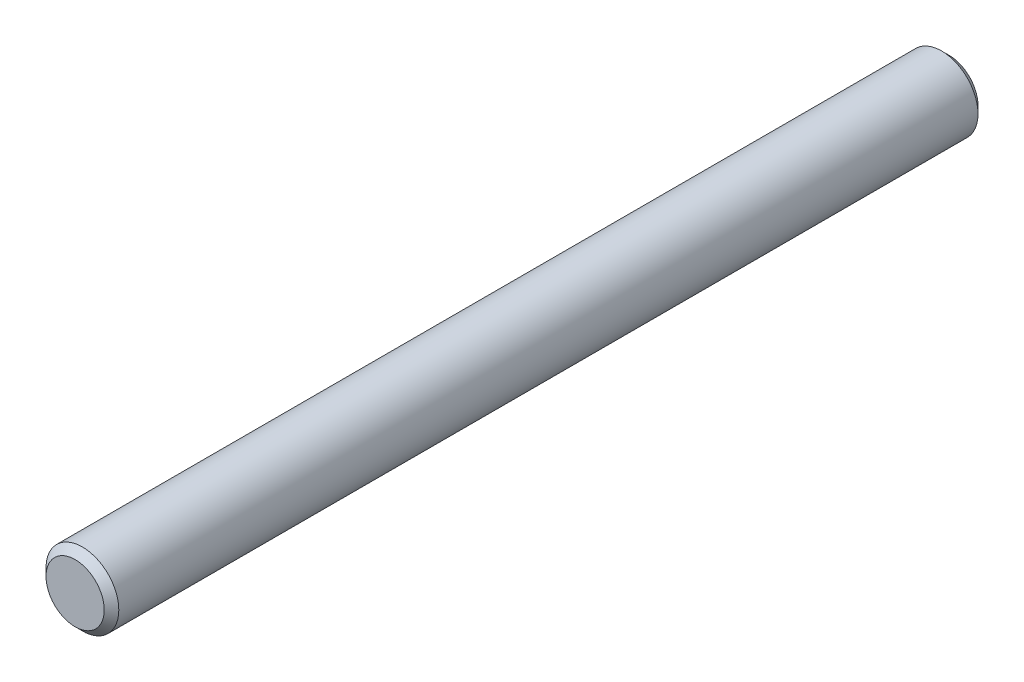
ISO-10303-21;
HEADER;
FILE_DESCRIPTION(('STEP AP214'),'2;1');
FILE_NAME('part.step','',(''),(''),'','','');
FILE_SCHEMA(('AUTOMOTIVE_DESIGN { 1 0 10303 214 1 1 1 1 }'));
ENDSEC;
DATA;
#1=APPLICATION_CONTEXT('core data for automotive mechanical design processes');
#2=APPLICATION_PROTOCOL_DEFINITION('international standard','automotive_design',2000,#1);
#3=PRODUCT_CONTEXT('',#1,'mechanical');
#4=PRODUCT('Part','Part','',(#3));
#5=PRODUCT_RELATED_PRODUCT_CATEGORY('part','',(#4));
#6=PRODUCT_DEFINITION_FORMATION('','',#4);
#7=PRODUCT_DEFINITION_CONTEXT('part definition',#1,'design');
#8=PRODUCT_DEFINITION('design','',#6,#7);
#9=PRODUCT_DEFINITION_SHAPE('','',#8);
#10=(LENGTH_UNIT() NAMED_UNIT(*) SI_UNIT(.MILLI.,.METRE.));
#11=(NAMED_UNIT(*) PLANE_ANGLE_UNIT() SI_UNIT($,.RADIAN.));
#12=(NAMED_UNIT(*) SI_UNIT($,.STERADIAN.) SOLID_ANGLE_UNIT());
#13=UNCERTAINTY_MEASURE_WITH_UNIT(LENGTH_MEASURE(1.E-05),#10,'distance_accuracy_value','');
#14=(GEOMETRIC_REPRESENTATION_CONTEXT(3) GLOBAL_UNCERTAINTY_ASSIGNED_CONTEXT((#13)) GLOBAL_UNIT_ASSIGNED_CONTEXT((#10,
#11,#12)) REPRESENTATION_CONTEXT('',''));
#15=CARTESIAN_POINT('',(0.,0.,0.));
#16=DIRECTION('',(0.,0.,1.));
#17=DIRECTION('',(1.,0.,0.));
#18=AXIS2_PLACEMENT_3D('',#15,#16,#17);
#19=CARTESIAN_POINT('',(0.,0.,152.4));
#20=DIRECTION('',(0.,0.,-1.));
#21=DIRECTION('',(-1.,0.,0.));
#22=AXIS2_PLACEMENT_3D('',#19,#20,#21);
#23=CYLINDRICAL_SURFACE('',#22,12.7);
#24=CARTESIAN_POINT('',(0.,0.,-149.86));
#25=DIRECTION('',(0.,0.,1.));
#26=DIRECTION('',(1.,0.,0.));
#27=AXIS2_PLACEMENT_3D('',#24,#25,#26);
#28=CIRCLE('',#27,12.7);
#29=CARTESIAN_POINT('',(12.7,0.,-149.86));
#30=VERTEX_POINT('',#29);
#31=EDGE_CURVE('E43',#30,#30,#28,.T.);
#32=ORIENTED_EDGE('',*,*,#31,.T.);
#33=EDGE_LOOP('',(#32));
#34=FACE_BOUND('',#33,.T.);
#35=CARTESIAN_POINT('',(0.,0.,149.86));
#36=DIRECTION('',(0.,0.,1.));
#37=DIRECTION('',(1.,0.,0.));
#38=AXIS2_PLACEMENT_3D('',#35,#36,#37);
#39=CIRCLE('',#38,12.7);
#40=CARTESIAN_POINT('',(12.7,0.,149.86));
#41=VERTEX_POINT('',#40);
#42=EDGE_CURVE('E47',#41,#41,#39,.F.);
#43=ORIENTED_EDGE('',*,*,#42,.T.);
#44=EDGE_LOOP('',(#43));
#45=FACE_BOUND('',#44,.T.);
#46=ADVANCED_FACE('F32',(#34,#45),#23,.T.);
#47=CARTESIAN_POINT('',(0.,0.,152.4));
#48=DIRECTION('',(0.,0.,1.));
#49=DIRECTION('',(1.,0.,0.));
#50=AXIS2_PLACEMENT_3D('',#47,#48,#49);
#51=PLANE('',#50);
#52=CARTESIAN_POINT('',(0.,0.,152.4));
#53=DIRECTION('',(0.,0.,1.));
#54=DIRECTION('',(1.,0.,0.));
#55=AXIS2_PLACEMENT_3D('',#52,#53,#54);
#56=CIRCLE('',#55,10.1600000000001);
#57=CARTESIAN_POINT('',(10.1600000000001,0.,152.4));
#58=VERTEX_POINT('',#57);
#59=EDGE_CURVE('E10',#58,#58,#56,.T.);
#60=ORIENTED_EDGE('',*,*,#59,.T.);
#61=EDGE_LOOP('',(#60));
#62=FACE_BOUND('',#61,.T.);
#63=ADVANCED_FACE('F63',(#62),#51,.T.);
#64=CARTESIAN_POINT('',(0.,0.,-152.4));
#65=DIRECTION('',(0.,0.,1.));
#66=DIRECTION('',(1.,0.,0.));
#67=AXIS2_PLACEMENT_3D('',#64,#65,#66);
#68=PLANE('',#67);
#69=CARTESIAN_POINT('',(0.,0.,-152.4));
#70=DIRECTION('',(0.,0.,1.));
#71=DIRECTION('',(1.,0.,0.));
#72=AXIS2_PLACEMENT_3D('',#69,#70,#71);
#73=CIRCLE('',#72,10.1599999999998);
#74=CARTESIAN_POINT('',(10.1599999999998,0.,-152.4));
#75=VERTEX_POINT('',#74);
#76=EDGE_CURVE('E39',#75,#75,#73,.F.);
#77=ORIENTED_EDGE('',*,*,#76,.T.);
#78=EDGE_LOOP('',(#77));
#79=FACE_BOUND('',#78,.T.);
#80=ADVANCED_FACE('F60',(#79),#68,.F.);
#81=CARTESIAN_POINT('',(0.,0.,-149.86));
#82=DIRECTION('',(0.,0.,1.));
#83=DIRECTION('',(1.,0.,0.));
#84=AXIS2_PLACEMENT_3D('',#81,#82,#83);
#85=CONICAL_SURFACE('',#84,12.7,0.785398163397445);
#86=ORIENTED_EDGE('',*,*,#76,.F.);
#87=EDGE_LOOP('',(#86));
#88=FACE_BOUND('',#87,.T.);
#89=ORIENTED_EDGE('',*,*,#31,.F.);
#90=EDGE_LOOP('',(#89));
#91=FACE_BOUND('',#90,.T.);
#92=ADVANCED_FACE('F56',(#88,#91),#85,.T.);
#93=CARTESIAN_POINT('',(0.,0.,152.4));
#94=DIRECTION('',(0.,0.,-1.));
#95=DIRECTION('',(-1.,0.,0.));
#96=AXIS2_PLACEMENT_3D('',#93,#94,#95);
#97=CONICAL_SURFACE('',#96,10.1600000000001,0.785398163397445);
#98=ORIENTED_EDGE('',*,*,#42,.F.);
#99=EDGE_LOOP('',(#98));
#100=FACE_BOUND('',#99,.T.);
#101=ORIENTED_EDGE('',*,*,#59,.F.);
#102=EDGE_LOOP('',(#101));
#103=FACE_BOUND('',#102,.T.);
#104=ADVANCED_FACE('F34',(#100,#103),#97,.T.);
#105=CLOSED_SHELL('',(#46,#63,#80,#92,#104));
#106=MANIFOLD_SOLID_BREP('B2',#105);
#107=ADVANCED_BREP_SHAPE_REPRESENTATION('',(#18,#106),#14);
#108=SHAPE_DEFINITION_REPRESENTATION(#9,#107);
ENDSEC;
END-ISO-10303-21;
